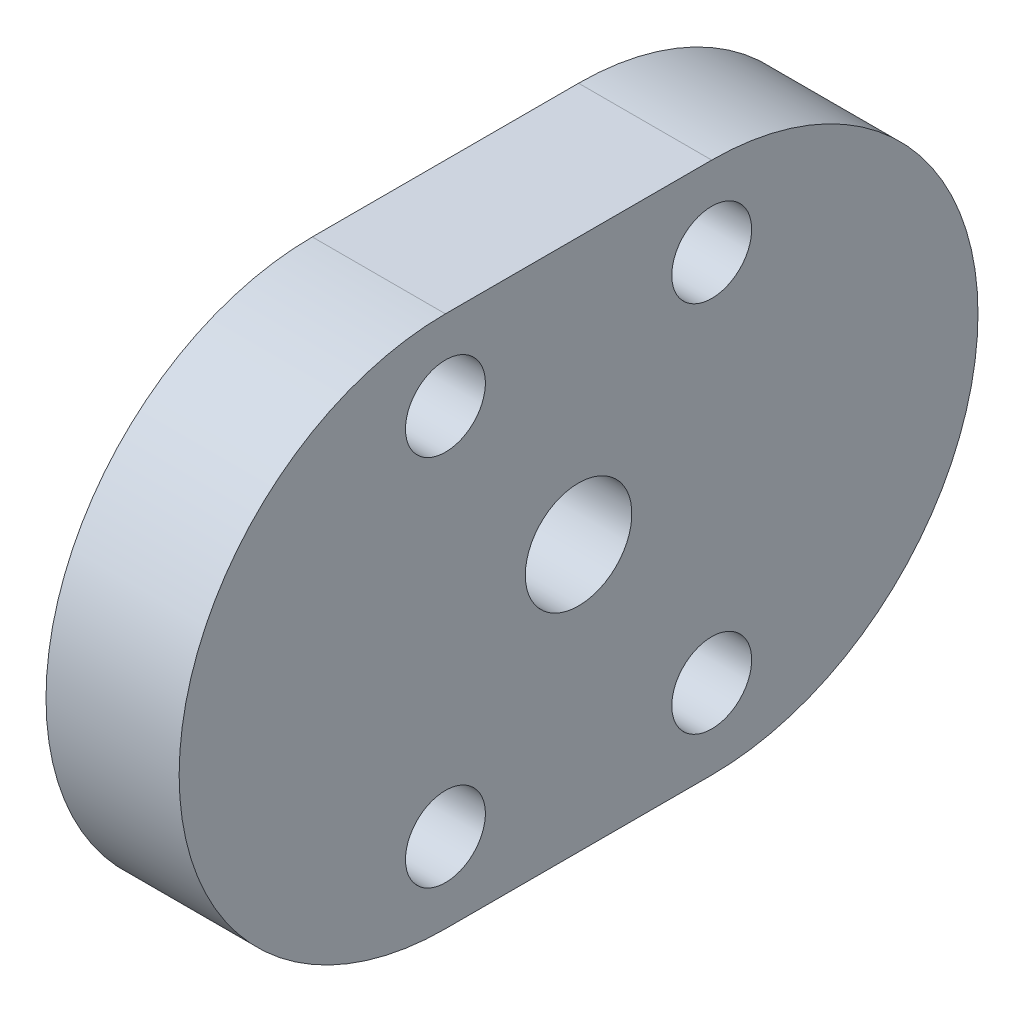
ISO-10303-21;
HEADER;
FILE_DESCRIPTION(('STEP AP214'),'2;1');
FILE_NAME('part.step','',(''),(''),'','','');
FILE_SCHEMA(('AUTOMOTIVE_DESIGN { 1 0 10303 214 1 1 1 1 }'));
ENDSEC;
DATA;
#1=APPLICATION_CONTEXT('core data for automotive mechanical design processes');
#2=APPLICATION_PROTOCOL_DEFINITION('international standard','automotive_design',2000,#1);
#3=PRODUCT_CONTEXT('',#1,'mechanical');
#4=PRODUCT('Part','Part','',(#3));
#5=PRODUCT_RELATED_PRODUCT_CATEGORY('part','',(#4));
#6=PRODUCT_DEFINITION_FORMATION('','',#4);
#7=PRODUCT_DEFINITION_CONTEXT('part definition',#1,'design');
#8=PRODUCT_DEFINITION('design','',#6,#7);
#9=PRODUCT_DEFINITION_SHAPE('','',#8);
#10=(LENGTH_UNIT() NAMED_UNIT(*) SI_UNIT(.MILLI.,.METRE.));
#11=(NAMED_UNIT(*) PLANE_ANGLE_UNIT() SI_UNIT($,.RADIAN.));
#12=(NAMED_UNIT(*) SI_UNIT($,.STERADIAN.) SOLID_ANGLE_UNIT());
#13=UNCERTAINTY_MEASURE_WITH_UNIT(LENGTH_MEASURE(1.E-05),#10,'distance_accuracy_value','');
#14=(GEOMETRIC_REPRESENTATION_CONTEXT(3) GLOBAL_UNCERTAINTY_ASSIGNED_CONTEXT((#13)) GLOBAL_UNIT_ASSIGNED_CONTEXT((#10,
#11,#12)) REPRESENTATION_CONTEXT('',''));
#15=CARTESIAN_POINT('',(0.,0.,0.));
#16=DIRECTION('',(0.,0.,1.));
#17=DIRECTION('',(1.,0.,0.));
#18=AXIS2_PLACEMENT_3D('',#15,#16,#17);
#19=CARTESIAN_POINT('',(5.,0.,-5.));
#20=DIRECTION('',(-1.,0.,0.));
#21=DIRECTION('',(0.,0.,-1.));
#22=AXIS2_PLACEMENT_3D('',#19,#20,#21);
#23=CYLINDRICAL_SURFACE('',#22,10.);
#24=CARTESIAN_POINT('',(0.,0.,-5.));
#25=DIRECTION('',(-1.,0.,0.));
#26=DIRECTION('',(0.,0.,1.));
#27=AXIS2_PLACEMENT_3D('',#24,#25,#26);
#28=CIRCLE('',#27,10.);
#29=CARTESIAN_POINT('',(0.,10.,-5.));
#30=VERTEX_POINT('',#29);
#31=CARTESIAN_POINT('',(0.,-10.,-5.));
#32=VERTEX_POINT('',#31);
#33=EDGE_CURVE('E103',#30,#32,#28,.T.);
#34=ORIENTED_EDGE('',*,*,#33,.F.);
#35=DIRECTION('',(-1.,0.,0.));
#36=VECTOR('',#35,1.);
#37=CARTESIAN_POINT('',(5.,10.,-5.));
#38=LINE('',#37,#36);
#39=CARTESIAN_POINT('',(5.,10.,-5.));
#40=VERTEX_POINT('',#39);
#41=EDGE_CURVE('E102',#40,#30,#38,.T.);
#42=ORIENTED_EDGE('',*,*,#41,.F.);
#43=CARTESIAN_POINT('',(5.,0.,-5.));
#44=DIRECTION('',(-1.,0.,0.));
#45=DIRECTION('',(0.,0.,1.));
#46=AXIS2_PLACEMENT_3D('',#43,#44,#45);
#47=CIRCLE('',#46,10.);
#48=CARTESIAN_POINT('',(5.,-10.,-5.));
#49=VERTEX_POINT('',#48);
#50=EDGE_CURVE('E96',#40,#49,#47,.T.);
#51=ORIENTED_EDGE('',*,*,#50,.T.);
#52=DIRECTION('',(-1.,0.,0.));
#53=VECTOR('',#52,1.);
#54=CARTESIAN_POINT('',(5.,-10.,-5.));
#55=LINE('',#54,#53);
#56=EDGE_CURVE('E11',#49,#32,#55,.T.);
#57=ORIENTED_EDGE('',*,*,#56,.T.);
#58=EDGE_LOOP('',(#34,#42,#51,#57));
#59=FACE_BOUND('',#58,.T.);
#60=ADVANCED_FACE('F39',(#59),#23,.T.);
#61=CARTESIAN_POINT('',(5.,-10.,-5.));
#62=DIRECTION('',(0.,1.,0.));
#63=DIRECTION('',(0.,0.,-1.));
#64=AXIS2_PLACEMENT_3D('',#61,#62,#63);
#65=PLANE('',#64);
#66=DIRECTION('',(0.,0.,1.));
#67=VECTOR('',#66,1.);
#68=CARTESIAN_POINT('',(0.,-10.,-5.));
#69=LINE('',#68,#67);
#70=CARTESIAN_POINT('',(0.,-10.,5.));
#71=VERTEX_POINT('',#70);
#72=EDGE_CURVE('E105',#32,#71,#69,.T.);
#73=ORIENTED_EDGE('',*,*,#72,.F.);
#74=ORIENTED_EDGE('',*,*,#56,.F.);
#75=DIRECTION('',(0.,0.,1.));
#76=VECTOR('',#75,1.);
#77=CARTESIAN_POINT('',(5.,-10.,-5.));
#78=LINE('',#77,#76);
#79=CARTESIAN_POINT('',(5.,-10.,5.));
#80=VERTEX_POINT('',#79);
#81=EDGE_CURVE('E80',#49,#80,#78,.T.);
#82=ORIENTED_EDGE('',*,*,#81,.T.);
#83=DIRECTION('',(-1.,0.,0.));
#84=VECTOR('',#83,1.);
#85=CARTESIAN_POINT('',(5.,-10.,5.));
#86=LINE('',#85,#84);
#87=EDGE_CURVE('E47',#80,#71,#86,.T.);
#88=ORIENTED_EDGE('',*,*,#87,.T.);
#89=EDGE_LOOP('',(#73,#74,#82,#88));
#90=FACE_BOUND('',#89,.T.);
#91=ADVANCED_FACE('F94',(#90),#65,.F.);
#92=CARTESIAN_POINT('',(5.,0.,5.));
#93=DIRECTION('',(-1.,0.,0.));
#94=DIRECTION('',(0.,0.,-1.));
#95=AXIS2_PLACEMENT_3D('',#92,#93,#94);
#96=CYLINDRICAL_SURFACE('',#95,10.);
#97=CARTESIAN_POINT('',(0.,0.,5.));
#98=DIRECTION('',(-1.,0.,0.));
#99=DIRECTION('',(0.,0.,-1.));
#100=AXIS2_PLACEMENT_3D('',#97,#98,#99);
#101=CIRCLE('',#100,10.);
#102=CARTESIAN_POINT('',(0.,10.,5.));
#103=VERTEX_POINT('',#102);
#104=EDGE_CURVE('E90',#71,#103,#101,.T.);
#105=ORIENTED_EDGE('',*,*,#104,.F.);
#106=ORIENTED_EDGE('',*,*,#87,.F.);
#107=CARTESIAN_POINT('',(5.,0.,5.));
#108=DIRECTION('',(-1.,0.,0.));
#109=DIRECTION('',(0.,0.,-1.));
#110=AXIS2_PLACEMENT_3D('',#107,#108,#109);
#111=CIRCLE('',#110,10.);
#112=CARTESIAN_POINT('',(5.,10.,5.));
#113=VERTEX_POINT('',#112);
#114=EDGE_CURVE('E83',#80,#113,#111,.T.);
#115=ORIENTED_EDGE('',*,*,#114,.T.);
#116=DIRECTION('',(-1.,0.,0.));
#117=VECTOR('',#116,1.);
#118=CARTESIAN_POINT('',(5.,10.,5.));
#119=LINE('',#118,#117);
#120=EDGE_CURVE('E93',#113,#103,#119,.T.);
#121=ORIENTED_EDGE('',*,*,#120,.T.);
#122=EDGE_LOOP('',(#105,#106,#115,#121));
#123=FACE_BOUND('',#122,.T.);
#124=ADVANCED_FACE('F89',(#123),#96,.T.);
#125=CARTESIAN_POINT('',(5.,10.,-5.));
#126=DIRECTION('',(0.,-1.,0.));
#127=DIRECTION('',(0.,0.,1.));
#128=AXIS2_PLACEMENT_3D('',#125,#126,#127);
#129=PLANE('',#128);
#130=DIRECTION('',(0.,0.,-1.));
#131=VECTOR('',#130,1.);
#132=CARTESIAN_POINT('',(0.,10.,-5.));
#133=LINE('',#132,#131);
#134=EDGE_CURVE('E69',#103,#30,#133,.T.);
#135=ORIENTED_EDGE('',*,*,#134,.F.);
#136=ORIENTED_EDGE('',*,*,#120,.F.);
#137=DIRECTION('',(0.,0.,-1.));
#138=VECTOR('',#137,1.);
#139=CARTESIAN_POINT('',(5.,10.,-5.));
#140=LINE('',#139,#138);
#141=EDGE_CURVE('E55',#113,#40,#140,.T.);
#142=ORIENTED_EDGE('',*,*,#141,.T.);
#143=ORIENTED_EDGE('',*,*,#41,.T.);
#144=EDGE_LOOP('',(#135,#136,#142,#143));
#145=FACE_BOUND('',#144,.T.);
#146=ADVANCED_FACE('F115',(#145),#129,.F.);
#147=CARTESIAN_POINT('',(5.,0.,-5.));
#148=DIRECTION('',(1.,0.,0.));
#149=DIRECTION('',(0.,0.,1.));
#150=AXIS2_PLACEMENT_3D('',#147,#148,#149);
#151=PLANE('',#150);
#152=CARTESIAN_POINT('',(5.,-7.,5.));
#153=DIRECTION('',(-1.,0.,0.));
#154=DIRECTION('',(0.,0.,1.));
#155=AXIS2_PLACEMENT_3D('',#152,#153,#154);
#156=CIRCLE('',#155,1.5);
#157=CARTESIAN_POINT('',(5.,-7.,6.5));
#158=VERTEX_POINT('',#157);
#159=EDGE_CURVE('E211',#158,#158,#156,.T.);
#160=ORIENTED_EDGE('',*,*,#159,.T.);
#161=EDGE_LOOP('',(#160));
#162=FACE_BOUND('',#161,.T.);
#163=CARTESIAN_POINT('',(5.,-7.,-5.));
#164=DIRECTION('',(-1.,0.,0.));
#165=DIRECTION('',(0.,0.,1.));
#166=AXIS2_PLACEMENT_3D('',#163,#164,#165);
#167=CIRCLE('',#166,1.5);
#168=CARTESIAN_POINT('',(5.,-7.,-3.5));
#169=VERTEX_POINT('',#168);
#170=EDGE_CURVE('E219',#169,#169,#167,.T.);
#171=ORIENTED_EDGE('',*,*,#170,.T.);
#172=EDGE_LOOP('',(#171));
#173=FACE_BOUND('',#172,.T.);
#174=CARTESIAN_POINT('',(5.,7.,5.));
#175=DIRECTION('',(-1.,0.,0.));
#176=DIRECTION('',(0.,0.,1.));
#177=AXIS2_PLACEMENT_3D('',#174,#175,#176);
#178=CIRCLE('',#177,1.5);
#179=CARTESIAN_POINT('',(5.,7.,6.5));
#180=VERTEX_POINT('',#179);
#181=EDGE_CURVE('E225',#180,#180,#178,.T.);
#182=ORIENTED_EDGE('',*,*,#181,.T.);
#183=EDGE_LOOP('',(#182));
#184=FACE_BOUND('',#183,.T.);
#185=CARTESIAN_POINT('',(5.,0.,0.));
#186=DIRECTION('',(-1.,0.,0.));
#187=DIRECTION('',(0.,0.,1.));
#188=AXIS2_PLACEMENT_3D('',#185,#186,#187);
#189=CIRCLE('',#188,2.);
#190=CARTESIAN_POINT('',(5.,0.,2.));
#191=VERTEX_POINT('',#190);
#192=EDGE_CURVE('E231',#191,#191,#189,.T.);
#193=ORIENTED_EDGE('',*,*,#192,.T.);
#194=EDGE_LOOP('',(#193));
#195=FACE_BOUND('',#194,.T.);
#196=CARTESIAN_POINT('',(5.,7.,-5.));
#197=DIRECTION('',(-1.,0.,0.));
#198=DIRECTION('',(0.,0.,1.));
#199=AXIS2_PLACEMENT_3D('',#196,#197,#198);
#200=CIRCLE('',#199,1.5);
#201=CARTESIAN_POINT('',(5.,7.,-3.5));
#202=VERTEX_POINT('',#201);
#203=EDGE_CURVE('E106',#202,#202,#200,.T.);
#204=ORIENTED_EDGE('',*,*,#203,.T.);
#205=EDGE_LOOP('',(#204));
#206=FACE_BOUND('',#205,.T.);
#207=ORIENTED_EDGE('',*,*,#50,.F.);
#208=ORIENTED_EDGE('',*,*,#141,.F.);
#209=ORIENTED_EDGE('',*,*,#114,.F.);
#210=ORIENTED_EDGE('',*,*,#81,.F.);
#211=EDGE_LOOP('',(#207,#208,#209,#210));
#212=FACE_BOUND('',#211,.T.);
#213=ADVANCED_FACE('F85',(#162,#173,#184,#195,#206,#212),#151,.T.);
#214=CARTESIAN_POINT('',(0.,0.,-5.));
#215=DIRECTION('',(1.,0.,0.));
#216=DIRECTION('',(0.,0.,1.));
#217=AXIS2_PLACEMENT_3D('',#214,#215,#216);
#218=PLANE('',#217);
#219=CARTESIAN_POINT('',(0.,-7.,5.));
#220=DIRECTION('',(-1.,0.,0.));
#221=DIRECTION('',(0.,0.,1.));
#222=AXIS2_PLACEMENT_3D('',#219,#220,#221);
#223=CIRCLE('',#222,1.5);
#224=CARTESIAN_POINT('',(0.,-7.,6.5));
#225=VERTEX_POINT('',#224);
#226=EDGE_CURVE('E214',#225,#225,#223,.T.);
#227=ORIENTED_EDGE('',*,*,#226,.F.);
#228=EDGE_LOOP('',(#227));
#229=FACE_BOUND('',#228,.T.);
#230=CARTESIAN_POINT('',(0.,-7.,-5.));
#231=DIRECTION('',(-1.,0.,0.));
#232=DIRECTION('',(0.,0.,1.));
#233=AXIS2_PLACEMENT_3D('',#230,#231,#232);
#234=CIRCLE('',#233,1.5);
#235=CARTESIAN_POINT('',(0.,-7.,-3.5));
#236=VERTEX_POINT('',#235);
#237=EDGE_CURVE('E216',#236,#236,#234,.T.);
#238=ORIENTED_EDGE('',*,*,#237,.F.);
#239=EDGE_LOOP('',(#238));
#240=FACE_BOUND('',#239,.T.);
#241=CARTESIAN_POINT('',(0.,7.,5.));
#242=DIRECTION('',(-1.,0.,0.));
#243=DIRECTION('',(0.,0.,1.));
#244=AXIS2_PLACEMENT_3D('',#241,#242,#243);
#245=CIRCLE('',#244,1.5);
#246=CARTESIAN_POINT('',(0.,7.,6.5));
#247=VERTEX_POINT('',#246);
#248=EDGE_CURVE('E222',#247,#247,#245,.T.);
#249=ORIENTED_EDGE('',*,*,#248,.F.);
#250=EDGE_LOOP('',(#249));
#251=FACE_BOUND('',#250,.T.);
#252=CARTESIAN_POINT('',(0.,0.,0.));
#253=DIRECTION('',(-1.,0.,0.));
#254=DIRECTION('',(0.,0.,1.));
#255=AXIS2_PLACEMENT_3D('',#252,#253,#254);
#256=CIRCLE('',#255,2.);
#257=CARTESIAN_POINT('',(0.,0.,2.));
#258=VERTEX_POINT('',#257);
#259=EDGE_CURVE('E228',#258,#258,#256,.T.);
#260=ORIENTED_EDGE('',*,*,#259,.F.);
#261=EDGE_LOOP('',(#260));
#262=FACE_BOUND('',#261,.T.);
#263=CARTESIAN_POINT('',(0.,7.,-5.));
#264=DIRECTION('',(-1.,0.,0.));
#265=DIRECTION('',(0.,0.,1.));
#266=AXIS2_PLACEMENT_3D('',#263,#264,#265);
#267=CIRCLE('',#266,1.5);
#268=CARTESIAN_POINT('',(0.,7.,-3.5));
#269=VERTEX_POINT('',#268);
#270=EDGE_CURVE('E234',#269,#269,#267,.T.);
#271=ORIENTED_EDGE('',*,*,#270,.F.);
#272=EDGE_LOOP('',(#271));
#273=FACE_BOUND('',#272,.T.);
#274=ORIENTED_EDGE('',*,*,#33,.T.);
#275=ORIENTED_EDGE('',*,*,#72,.T.);
#276=ORIENTED_EDGE('',*,*,#104,.T.);
#277=ORIENTED_EDGE('',*,*,#134,.T.);
#278=EDGE_LOOP('',(#274,#275,#276,#277));
#279=FACE_BOUND('',#278,.T.);
#280=ADVANCED_FACE('F111',(#229,#240,#251,#262,#273,#279),#218,.F.);
#281=CARTESIAN_POINT('',(5.,7.,-5.));
#282=DIRECTION('',(-1.,0.,0.));
#283=DIRECTION('',(0.,0.,-1.));
#284=AXIS2_PLACEMENT_3D('',#281,#282,#283);
#285=CYLINDRICAL_SURFACE('',#284,1.5);
#286=ORIENTED_EDGE('',*,*,#203,.F.);
#287=EDGE_LOOP('',(#286));
#288=FACE_BOUND('',#287,.T.);
#289=ORIENTED_EDGE('',*,*,#270,.T.);
#290=EDGE_LOOP('',(#289));
#291=FACE_BOUND('',#290,.T.);
#292=ADVANCED_FACE('F155',(#288,#291),#285,.F.);
#293=CARTESIAN_POINT('',(5.,0.,0.));
#294=DIRECTION('',(-1.,0.,0.));
#295=DIRECTION('',(0.,0.,-1.));
#296=AXIS2_PLACEMENT_3D('',#293,#294,#295);
#297=CYLINDRICAL_SURFACE('',#296,2.);
#298=ORIENTED_EDGE('',*,*,#192,.F.);
#299=EDGE_LOOP('',(#298));
#300=FACE_BOUND('',#299,.T.);
#301=ORIENTED_EDGE('',*,*,#259,.T.);
#302=EDGE_LOOP('',(#301));
#303=FACE_BOUND('',#302,.T.);
#304=ADVANCED_FACE('F164',(#300,#303),#297,.F.);
#305=CARTESIAN_POINT('',(5.,7.,5.));
#306=DIRECTION('',(-1.,0.,0.));
#307=DIRECTION('',(0.,0.,-1.));
#308=AXIS2_PLACEMENT_3D('',#305,#306,#307);
#309=CYLINDRICAL_SURFACE('',#308,1.5);
#310=ORIENTED_EDGE('',*,*,#181,.F.);
#311=EDGE_LOOP('',(#310));
#312=FACE_BOUND('',#311,.T.);
#313=ORIENTED_EDGE('',*,*,#248,.T.);
#314=EDGE_LOOP('',(#313));
#315=FACE_BOUND('',#314,.T.);
#316=ADVANCED_FACE('F174',(#312,#315),#309,.F.);
#317=CARTESIAN_POINT('',(5.,-7.,-5.));
#318=DIRECTION('',(-1.,0.,0.));
#319=DIRECTION('',(0.,0.,-1.));
#320=AXIS2_PLACEMENT_3D('',#317,#318,#319);
#321=CYLINDRICAL_SURFACE('',#320,1.5);
#322=ORIENTED_EDGE('',*,*,#170,.F.);
#323=EDGE_LOOP('',(#322));
#324=FACE_BOUND('',#323,.T.);
#325=ORIENTED_EDGE('',*,*,#237,.T.);
#326=EDGE_LOOP('',(#325));
#327=FACE_BOUND('',#326,.T.);
#328=ADVANCED_FACE('F184',(#324,#327),#321,.F.);
#329=CARTESIAN_POINT('',(5.,-7.,5.));
#330=DIRECTION('',(-1.,0.,0.));
#331=DIRECTION('',(0.,0.,-1.));
#332=AXIS2_PLACEMENT_3D('',#329,#330,#331);
#333=CYLINDRICAL_SURFACE('',#332,1.5);
#334=ORIENTED_EDGE('',*,*,#159,.F.);
#335=EDGE_LOOP('',(#334));
#336=FACE_BOUND('',#335,.T.);
#337=ORIENTED_EDGE('',*,*,#226,.T.);
#338=EDGE_LOOP('',(#337));
#339=FACE_BOUND('',#338,.T.);
#340=ADVANCED_FACE('F194',(#336,#339),#333,.F.);
#341=CLOSED_SHELL('',(#60,#91,#124,#146,#213,#280,#292,#304,#316,#328,#340));
#342=MANIFOLD_SOLID_BREP('B2',#341);
#343=ADVANCED_BREP_SHAPE_REPRESENTATION('',(#18,#342),#14);
#344=SHAPE_DEFINITION_REPRESENTATION(#9,#343);
ENDSEC;
END-ISO-10303-21;
